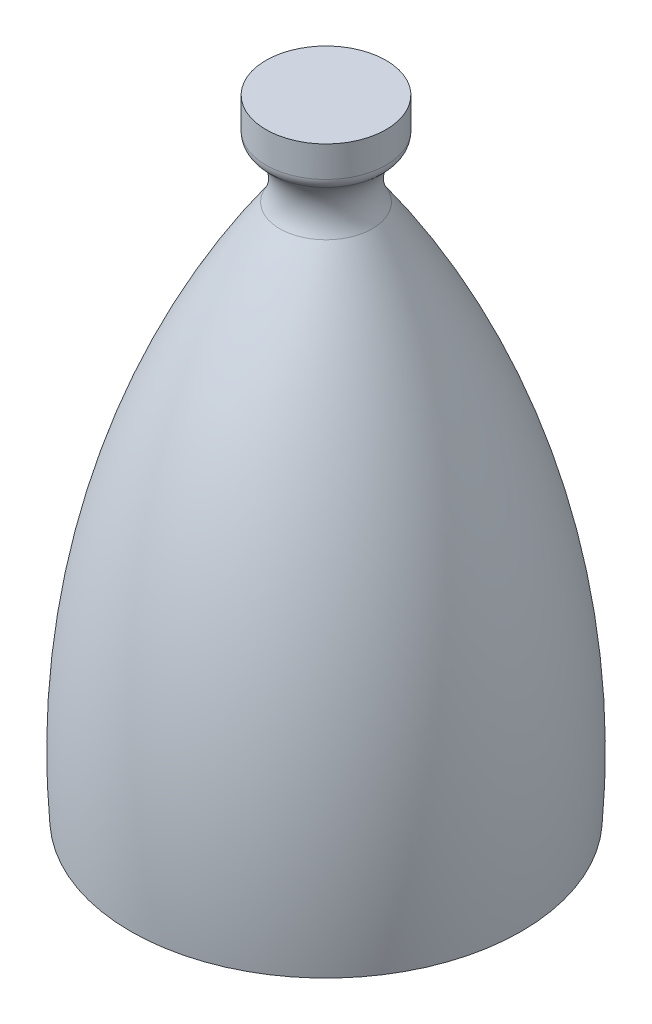
ISO-10303-21;
HEADER;
FILE_DESCRIPTION(('STEP AP214'),'2;1');
FILE_NAME('part.step','',(''),(''),'','','');
FILE_SCHEMA(('AUTOMOTIVE_DESIGN { 1 0 10303 214 1 1 1 1 }'));
ENDSEC;
DATA;
#1=APPLICATION_CONTEXT('core data for automotive mechanical design processes');
#2=APPLICATION_PROTOCOL_DEFINITION('international standard','automotive_design',2000,#1);
#3=PRODUCT_CONTEXT('',#1,'mechanical');
#4=PRODUCT('Part','Part','',(#3));
#5=PRODUCT_RELATED_PRODUCT_CATEGORY('part','',(#4));
#6=PRODUCT_DEFINITION_FORMATION('','',#4);
#7=PRODUCT_DEFINITION_CONTEXT('part definition',#1,'design');
#8=PRODUCT_DEFINITION('design','',#6,#7);
#9=PRODUCT_DEFINITION_SHAPE('','',#8);
#10=(LENGTH_UNIT() NAMED_UNIT(*) SI_UNIT(.MILLI.,.METRE.));
#11=(NAMED_UNIT(*) PLANE_ANGLE_UNIT() SI_UNIT($,.RADIAN.));
#12=(NAMED_UNIT(*) SI_UNIT($,.STERADIAN.) SOLID_ANGLE_UNIT());
#13=UNCERTAINTY_MEASURE_WITH_UNIT(LENGTH_MEASURE(1.E-05),#10,'distance_accuracy_value','');
#14=(GEOMETRIC_REPRESENTATION_CONTEXT(3) GLOBAL_UNCERTAINTY_ASSIGNED_CONTEXT((#13)) GLOBAL_UNIT_ASSIGNED_CONTEXT((#10,
#11,#12)) REPRESENTATION_CONTEXT('',''));
#15=CARTESIAN_POINT('',(0.,0.,0.));
#16=DIRECTION('',(0.,0.,1.));
#17=DIRECTION('',(1.,0.,0.));
#18=AXIS2_PLACEMENT_3D('',#15,#16,#17);
#19=CARTESIAN_POINT('',(71.7029063234353,607.968222433962,0.));
#20=DIRECTION('',(0.,-1.,0.));
#21=DIRECTION('',(0.,0.,-1.));
#22=AXIS2_PLACEMENT_3D('',#19,#20,#21);
#23=DEGENERATE_TOROIDAL_SURFACE('',#22,461.628008582917,607.914040992927,.F.);
#24=CARTESIAN_POINT('',(71.7029063234354,959.585843719148,0.));
#25=DIRECTION('',(0.,-1.,0.));
#26=DIRECTION('',(0.,0.,-1.));
#27=AXIS2_PLACEMENT_3D('',#24,#25,#26);
#28=CIRCLE('',#27,34.2797748184903);
#29=CARTESIAN_POINT('',(71.7029063234354,959.585843719148,-34.2797748184903));
#30=VERTEX_POINT('',#29);
#31=EDGE_CURVE('E46',#30,#30,#28,.T.);
#32=ORIENTED_EDGE('',*,*,#31,.T.);
#33=EDGE_LOOP('',(#32));
#34=FACE_BOUND('',#33,.T.);
#35=CARTESIAN_POINT('',(71.7029063234354,564.083974186739,0.));
#36=DIRECTION('',(0.,-1.,0.));
#37=DIRECTION('',(0.,0.,-1.));
#38=AXIS2_PLACEMENT_3D('',#35,#36,#37);
#39=CIRCLE('',#38,144.7);
#40=CARTESIAN_POINT('',(71.7029063234354,564.083974186739,-144.7));
#41=VERTEX_POINT('',#40);
#42=EDGE_CURVE('E50',#41,#41,#39,.T.);
#43=ORIENTED_EDGE('',*,*,#42,.F.);
#44=EDGE_LOOP('',(#43));
#45=FACE_BOUND('',#44,.T.);
#46=ADVANCED_FACE('F35',(#34,#45),#23,.F.);
#47=CARTESIAN_POINT('',(71.7029063234354,974.87383025393,0.));
#48=DIRECTION('',(0.,-1.,0.));
#49=DIRECTION('',(0.,0.,-1.));
#50=AXIS2_PLACEMENT_3D('',#47,#48,#49);
#51=TOROIDAL_SURFACE('',#50,59.7597523764606,29.7145046844524);
#52=CARTESIAN_POINT('',(71.7029063234354,997.785941473113,0.));
#53=DIRECTION('',(0.,-1.,0.));
#54=DIRECTION('',(0.,0.,-1.));
#55=AXIS2_PLACEMENT_3D('',#52,#53,#54);
#56=CIRCLE('',#55,40.8392093577704);
#57=CARTESIAN_POINT('',(71.7029063234354,997.785941473113,-40.8392093577704));
#58=VERTEX_POINT('',#57);
#59=EDGE_CURVE('E42',#58,#58,#56,.T.);
#60=ORIENTED_EDGE('',*,*,#59,.T.);
#61=EDGE_LOOP('',(#60));
#62=FACE_BOUND('',#61,.T.);
#63=ORIENTED_EDGE('',*,*,#31,.F.);
#64=EDGE_LOOP('',(#63));
#65=FACE_BOUND('',#64,.T.);
#66=ADVANCED_FACE('F72',(#62,#65),#51,.F.);
#67=CARTESIAN_POINT('',(0.,564.083974186739,0.));
#68=DIRECTION('',(0.,-1.,0.));
#69=DIRECTION('',(0.,0.,-1.));
#70=AXIS2_PLACEMENT_3D('',#67,#68,#69);
#71=PLANE('',#70);
#72=ORIENTED_EDGE('',*,*,#42,.T.);
#73=EDGE_LOOP('',(#72));
#74=FACE_BOUND('',#73,.T.);
#75=ADVANCED_FACE('F69',(#74),#71,.T.);
#76=CARTESIAN_POINT('',(71.7029063234354,564.083974186739,0.));
#77=DIRECTION('',(0.,-1.,0.));
#78=DIRECTION('',(0.,0.,-1.));
#79=AXIS2_PLACEMENT_3D('',#76,#77,#78);
#80=CYLINDRICAL_SURFACE('',#79,44.4717658416783);
#81=CARTESIAN_POINT('',(71.7029063234354,1005.49669131145,0.));
#82=DIRECTION('',(0.,1.,0.));
#83=DIRECTION('',(0.,0.,1.));
#84=AXIS2_PLACEMENT_3D('',#81,#82,#83);
#85=CIRCLE('',#84,44.4717658416783);
#86=CARTESIAN_POINT('',(71.7029063234354,1005.49669131145,44.4717658416783));
#87=VERTEX_POINT('',#86);
#88=EDGE_CURVE('E10',#87,#87,#85,.T.);
#89=ORIENTED_EDGE('',*,*,#88,.T.);
#90=EDGE_LOOP('',(#89));
#91=FACE_BOUND('',#90,.T.);
#92=CARTESIAN_POINT('',(71.7029063234354,1028.27997418674,0.));
#93=DIRECTION('',(0.,-1.,0.));
#94=DIRECTION('',(0.,0.,-1.));
#95=AXIS2_PLACEMENT_3D('',#92,#93,#94);
#96=CIRCLE('',#95,44.4717658416783);
#97=CARTESIAN_POINT('',(71.7029063234354,1028.27997418674,-44.4717658416783));
#98=VERTEX_POINT('',#97);
#99=EDGE_CURVE('E55',#98,#98,#96,.T.);
#100=ORIENTED_EDGE('',*,*,#99,.T.);
#101=EDGE_LOOP('',(#100));
#102=FACE_BOUND('',#101,.T.);
#103=ADVANCED_FACE('F59',(#91,#102),#80,.T.);
#104=CARTESIAN_POINT('',(0.,1028.27997418674,0.));
#105=DIRECTION('',(0.,-1.,0.));
#106=DIRECTION('',(0.,0.,-1.));
#107=AXIS2_PLACEMENT_3D('',#104,#105,#106);
#108=PLANE('',#107);
#109=ORIENTED_EDGE('',*,*,#99,.F.);
#110=EDGE_LOOP('',(#109));
#111=FACE_BOUND('',#110,.T.);
#112=ADVANCED_FACE('F61',(#111),#108,.F.);
#113=CARTESIAN_POINT('',(71.7029063234354,1005.49669131145,0.));
#114=DIRECTION('',(0.,1.,0.));
#115=DIRECTION('',(0.,0.,1.));
#116=AXIS2_PLACEMENT_3D('',#113,#114,#115);
#117=TOROIDAL_SURFACE('',#116,34.4717658416784,10.);
#118=ORIENTED_EDGE('',*,*,#88,.F.);
#119=EDGE_LOOP('',(#118));
#120=FACE_BOUND('',#119,.T.);
#121=ORIENTED_EDGE('',*,*,#59,.F.);
#122=EDGE_LOOP('',(#121));
#123=FACE_BOUND('',#122,.T.);
#124=ADVANCED_FACE('F37',(#120,#123),#117,.T.);
#125=CLOSED_SHELL('',(#46,#66,#75,#103,#112,#124));
#126=MANIFOLD_SOLID_BREP('B2',#125);
#127=ADVANCED_BREP_SHAPE_REPRESENTATION('',(#18,#126),#14);
#128=SHAPE_DEFINITION_REPRESENTATION(#9,#127);
ENDSEC;
END-ISO-10303-21;
